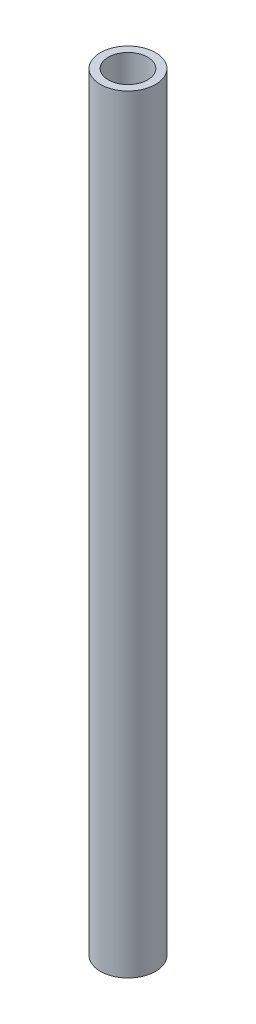
ISO-10303-21;
HEADER;
FILE_DESCRIPTION(('STEP AP214'),'2;1');
FILE_NAME('part.step','',(''),(''),'','','');
FILE_SCHEMA(('AUTOMOTIVE_DESIGN { 1 0 10303 214 1 1 1 1 }'));
ENDSEC;
DATA;
#1=APPLICATION_CONTEXT('core data for automotive mechanical design processes');
#2=APPLICATION_PROTOCOL_DEFINITION('international standard','automotive_design',2000,#1);
#3=PRODUCT_CONTEXT('',#1,'mechanical');
#4=PRODUCT('Part','Part','',(#3));
#5=PRODUCT_RELATED_PRODUCT_CATEGORY('part','',(#4));
#6=PRODUCT_DEFINITION_FORMATION('','',#4);
#7=PRODUCT_DEFINITION_CONTEXT('part definition',#1,'design');
#8=PRODUCT_DEFINITION('design','',#6,#7);
#9=PRODUCT_DEFINITION_SHAPE('','',#8);
#10=(LENGTH_UNIT() NAMED_UNIT(*) SI_UNIT(.MILLI.,.METRE.));
#11=(NAMED_UNIT(*) PLANE_ANGLE_UNIT() SI_UNIT($,.RADIAN.));
#12=(NAMED_UNIT(*) SI_UNIT($,.STERADIAN.) SOLID_ANGLE_UNIT());
#13=UNCERTAINTY_MEASURE_WITH_UNIT(LENGTH_MEASURE(1.E-05),#10,'distance_accuracy_value','');
#14=(GEOMETRIC_REPRESENTATION_CONTEXT(3) GLOBAL_UNCERTAINTY_ASSIGNED_CONTEXT((#13)) GLOBAL_UNIT_ASSIGNED_CONTEXT((#10,
#11,#12)) REPRESENTATION_CONTEXT('',''));
#15=CARTESIAN_POINT('',(0.,0.,0.));
#16=DIRECTION('',(0.,0.,1.));
#17=DIRECTION('',(1.,0.,0.));
#18=AXIS2_PLACEMENT_3D('',#15,#16,#17);
#19=CARTESIAN_POINT('',(0.,195.,0.));
#20=DIRECTION('',(0.,1.,0.));
#21=DIRECTION('',(0.,0.,1.));
#22=AXIS2_PLACEMENT_3D('',#19,#20,#21);
#23=PLANE('',#22);
#24=CARTESIAN_POINT('',(0.,195.,0.));
#25=DIRECTION('',(0.,1.,0.));
#26=DIRECTION('',(0.,0.,1.));
#27=AXIS2_PLACEMENT_3D('',#24,#25,#26);
#28=CIRCLE('',#27,7.);
#29=CARTESIAN_POINT('',(0.,195.,7.));
#30=VERTEX_POINT('',#29);
#31=EDGE_CURVE('E10',#30,#30,#28,.T.);
#32=ORIENTED_EDGE('',*,*,#31,.T.);
#33=EDGE_LOOP('',(#32));
#34=FACE_BOUND('',#33,.T.);
#35=CARTESIAN_POINT('',(0.,195.,0.));
#36=DIRECTION('',(0.,1.,0.));
#37=DIRECTION('',(0.,0.,1.));
#38=AXIS2_PLACEMENT_3D('',#35,#36,#37);
#39=CIRCLE('',#38,5.);
#40=CARTESIAN_POINT('',(0.,195.,5.));
#41=VERTEX_POINT('',#40);
#42=EDGE_CURVE('E52',#41,#41,#39,.T.);
#43=ORIENTED_EDGE('',*,*,#42,.F.);
#44=EDGE_LOOP('',(#43));
#45=FACE_BOUND('',#44,.T.);
#46=ADVANCED_FACE('F39',(#34,#45),#23,.T.);
#47=CARTESIAN_POINT('',(0.,0.,0.));
#48=DIRECTION('',(0.,1.,0.));
#49=DIRECTION('',(0.,0.,1.));
#50=AXIS2_PLACEMENT_3D('',#47,#48,#49);
#51=PLANE('',#50);
#52=CARTESIAN_POINT('',(0.,0.,0.));
#53=DIRECTION('',(0.,1.,0.));
#54=DIRECTION('',(0.,0.,1.));
#55=AXIS2_PLACEMENT_3D('',#52,#53,#54);
#56=CIRCLE('',#55,7.);
#57=CARTESIAN_POINT('',(0.,0.,7.));
#58=VERTEX_POINT('',#57);
#59=EDGE_CURVE('E43',#58,#58,#56,.T.);
#60=ORIENTED_EDGE('',*,*,#59,.F.);
#61=EDGE_LOOP('',(#60));
#62=FACE_BOUND('',#61,.T.);
#63=CARTESIAN_POINT('',(0.,0.,0.));
#64=DIRECTION('',(0.,1.,0.));
#65=DIRECTION('',(0.,0.,1.));
#66=AXIS2_PLACEMENT_3D('',#63,#64,#65);
#67=CIRCLE('',#66,5.);
#68=CARTESIAN_POINT('',(0.,0.,5.));
#69=VERTEX_POINT('',#68);
#70=EDGE_CURVE('E54',#69,#69,#67,.T.);
#71=ORIENTED_EDGE('',*,*,#70,.T.);
#72=EDGE_LOOP('',(#71));
#73=FACE_BOUND('',#72,.T.);
#74=ADVANCED_FACE('F66',(#62,#73),#51,.F.);
#75=CARTESIAN_POINT('',(0.,195.,0.));
#76=DIRECTION('',(0.,-1.,0.));
#77=DIRECTION('',(0.,0.,-1.));
#78=AXIS2_PLACEMENT_3D('',#75,#76,#77);
#79=CYLINDRICAL_SURFACE('',#78,7.);
#80=ORIENTED_EDGE('',*,*,#31,.F.);
#81=EDGE_LOOP('',(#80));
#82=FACE_BOUND('',#81,.T.);
#83=ORIENTED_EDGE('',*,*,#59,.T.);
#84=EDGE_LOOP('',(#83));
#85=FACE_BOUND('',#84,.T.);
#86=ADVANCED_FACE('F41',(#82,#85),#79,.T.);
#87=CARTESIAN_POINT('',(0.,195.,0.));
#88=DIRECTION('',(0.,-1.,0.));
#89=DIRECTION('',(0.,0.,-1.));
#90=AXIS2_PLACEMENT_3D('',#87,#88,#89);
#91=CYLINDRICAL_SURFACE('',#90,5.);
#92=ORIENTED_EDGE('',*,*,#42,.T.);
#93=EDGE_LOOP('',(#92));
#94=FACE_BOUND('',#93,.T.);
#95=ORIENTED_EDGE('',*,*,#70,.F.);
#96=EDGE_LOOP('',(#95));
#97=FACE_BOUND('',#96,.T.);
#98=ADVANCED_FACE('F62',(#94,#97),#91,.F.);
#99=CLOSED_SHELL('',(#46,#74,#86,#98));
#100=MANIFOLD_SOLID_BREP('B2',#99);
#101=ADVANCED_BREP_SHAPE_REPRESENTATION('',(#18,#100),#14);
#102=SHAPE_DEFINITION_REPRESENTATION(#9,#101);
ENDSEC;
END-ISO-10303-21;
